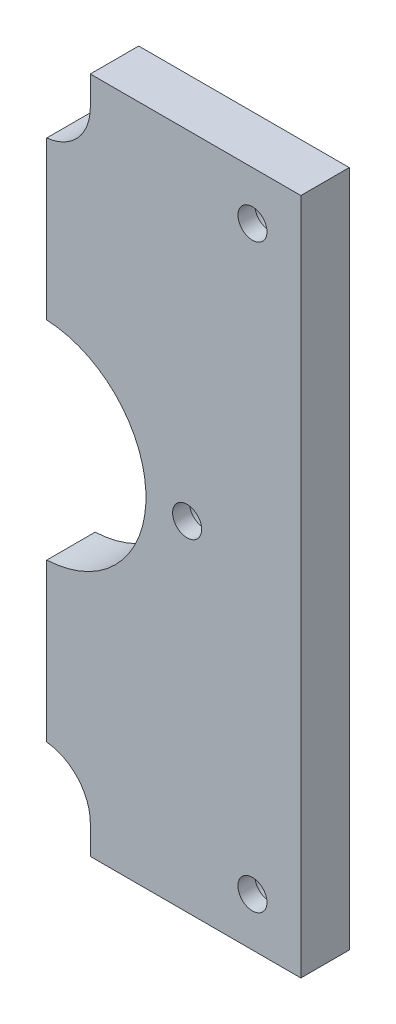
ISO-10303-21;
HEADER;
FILE_DESCRIPTION(('STEP AP214'),'2;1');
FILE_NAME('part.step','',(''),(''),'','','');
FILE_SCHEMA(('AUTOMOTIVE_DESIGN { 1 0 10303 214 1 1 1 1 }'));
ENDSEC;
DATA;
#1=APPLICATION_CONTEXT('core data for automotive mechanical design processes');
#2=APPLICATION_PROTOCOL_DEFINITION('international standard','automotive_design',2000,#1);
#3=PRODUCT_CONTEXT('',#1,'mechanical');
#4=PRODUCT('Part','Part','',(#3));
#5=PRODUCT_RELATED_PRODUCT_CATEGORY('part','',(#4));
#6=PRODUCT_DEFINITION_FORMATION('','',#4);
#7=PRODUCT_DEFINITION_CONTEXT('part definition',#1,'design');
#8=PRODUCT_DEFINITION('design','',#6,#7);
#9=PRODUCT_DEFINITION_SHAPE('','',#8);
#10=(LENGTH_UNIT() NAMED_UNIT(*) SI_UNIT(.MILLI.,.METRE.));
#11=(NAMED_UNIT(*) PLANE_ANGLE_UNIT() SI_UNIT($,.RADIAN.));
#12=(NAMED_UNIT(*) SI_UNIT($,.STERADIAN.) SOLID_ANGLE_UNIT());
#13=UNCERTAINTY_MEASURE_WITH_UNIT(LENGTH_MEASURE(1.E-05),#10,'distance_accuracy_value','');
#14=(GEOMETRIC_REPRESENTATION_CONTEXT(3) GLOBAL_UNCERTAINTY_ASSIGNED_CONTEXT((#13)) GLOBAL_UNIT_ASSIGNED_CONTEXT((#10,
#11,#12)) REPRESENTATION_CONTEXT('',''));
#15=CARTESIAN_POINT('',(0.,0.,0.));
#16=DIRECTION('',(0.,0.,1.));
#17=DIRECTION('',(1.,0.,0.));
#18=AXIS2_PLACEMENT_3D('',#15,#16,#17);
#19=CARTESIAN_POINT('',(80.,130.,10.));
#20=DIRECTION('',(0.,0.,-1.));
#21=DIRECTION('',(-1.,0.,0.));
#22=AXIS2_PLACEMENT_3D('',#19,#20,#21);
#23=CYLINDRICAL_SURFACE('',#22,2.99999999999999);
#24=CARTESIAN_POINT('',(80.,130.,10.));
#25=DIRECTION('',(0.,0.,1.));
#26=DIRECTION('',(1.,0.,0.));
#27=AXIS2_PLACEMENT_3D('',#24,#25,#26);
#28=CIRCLE('',#27,2.99999999999999);
#29=CARTESIAN_POINT('',(83.,130.,10.));
#30=VERTEX_POINT('',#29);
#31=EDGE_CURVE('E180',#30,#30,#28,.T.);
#32=ORIENTED_EDGE('',*,*,#31,.T.);
#33=EDGE_LOOP('',(#32));
#34=FACE_BOUND('',#33,.T.);
#35=CARTESIAN_POINT('',(80.,130.,6.5));
#36=DIRECTION('',(0.,0.,-1.));
#37=DIRECTION('',(-1.,0.,0.));
#38=AXIS2_PLACEMENT_3D('',#35,#36,#37);
#39=CIRCLE('',#38,2.99999999999999);
#40=CARTESIAN_POINT('',(77.0000000000001,130.,6.5));
#41=VERTEX_POINT('',#40);
#42=EDGE_CURVE('E33',#41,#41,#39,.T.);
#43=ORIENTED_EDGE('',*,*,#42,.T.);
#44=EDGE_LOOP('',(#43));
#45=FACE_BOUND('',#44,.T.);
#46=ADVANCED_FACE('F29',(#34,#45),#23,.F.);
#47=CARTESIAN_POINT('',(80.,10.,10.));
#48=DIRECTION('',(0.,0.,-1.));
#49=DIRECTION('',(-1.,0.,0.));
#50=AXIS2_PLACEMENT_3D('',#47,#48,#49);
#51=CYLINDRICAL_SURFACE('',#50,2.99999999999999);
#52=CARTESIAN_POINT('',(80.,10.,10.));
#53=DIRECTION('',(0.,0.,1.));
#54=DIRECTION('',(1.,0.,0.));
#55=AXIS2_PLACEMENT_3D('',#52,#53,#54);
#56=CIRCLE('',#55,2.99999999999999);
#57=CARTESIAN_POINT('',(83.,10.,10.));
#58=VERTEX_POINT('',#57);
#59=EDGE_CURVE('E174',#58,#58,#56,.T.);
#60=ORIENTED_EDGE('',*,*,#59,.T.);
#61=EDGE_LOOP('',(#60));
#62=FACE_BOUND('',#61,.T.);
#63=CARTESIAN_POINT('',(80.,10.,6.5));
#64=DIRECTION('',(0.,0.,-1.));
#65=DIRECTION('',(-1.,0.,0.));
#66=AXIS2_PLACEMENT_3D('',#63,#64,#65);
#67=CIRCLE('',#66,2.99999999999999);
#68=CARTESIAN_POINT('',(77.,10.,6.5));
#69=VERTEX_POINT('',#68);
#70=EDGE_CURVE('E201',#69,#69,#67,.T.);
#71=ORIENTED_EDGE('',*,*,#70,.T.);
#72=EDGE_LOOP('',(#71));
#73=FACE_BOUND('',#72,.T.);
#74=ADVANCED_FACE('F241',(#62,#73),#51,.F.);
#75=CARTESIAN_POINT('',(66.4999999999925,70.,10.));
#76=DIRECTION('',(0.,0.,-1.));
#77=DIRECTION('',(-1.,0.,0.));
#78=AXIS2_PLACEMENT_3D('',#75,#76,#77);
#79=CYLINDRICAL_SURFACE('',#78,3.00000000000001);
#80=CARTESIAN_POINT('',(66.4999999999925,70.,10.));
#81=DIRECTION('',(0.,0.,1.));
#82=DIRECTION('',(1.,0.,0.));
#83=AXIS2_PLACEMENT_3D('',#80,#81,#82);
#84=CIRCLE('',#83,3.00000000000001);
#85=CARTESIAN_POINT('',(69.4999999999925,70.,10.));
#86=VERTEX_POINT('',#85);
#87=EDGE_CURVE('E177',#86,#86,#84,.T.);
#88=ORIENTED_EDGE('',*,*,#87,.T.);
#89=EDGE_LOOP('',(#88));
#90=FACE_BOUND('',#89,.T.);
#91=CARTESIAN_POINT('',(66.4999999999925,70.,6.5));
#92=DIRECTION('',(0.,0.,-1.));
#93=DIRECTION('',(-1.,0.,0.));
#94=AXIS2_PLACEMENT_3D('',#91,#92,#93);
#95=CIRCLE('',#94,3.00000000000001);
#96=CARTESIAN_POINT('',(63.4999999999925,70.,6.5));
#97=VERTEX_POINT('',#96);
#98=EDGE_CURVE('E123',#97,#97,#95,.T.);
#99=ORIENTED_EDGE('',*,*,#98,.T.);
#100=EDGE_LOOP('',(#99));
#101=FACE_BOUND('',#100,.T.);
#102=ADVANCED_FACE('F247',(#90,#101),#79,.F.);
#103=CARTESIAN_POINT('',(36.5,6.00000000000006,10.));
#104=DIRECTION('',(0.,0.,-1.));
#105=DIRECTION('',(-1.,0.,0.));
#106=AXIS2_PLACEMENT_3D('',#103,#104,#105);
#107=CYLINDRICAL_SURFACE('',#106,10.);
#108=CARTESIAN_POINT('',(36.5,6.00000000000006,0.));
#109=DIRECTION('',(0.,0.,1.));
#110=DIRECTION('',(1.,0.,0.));
#111=AXIS2_PLACEMENT_3D('',#108,#109,#110);
#112=CIRCLE('',#111,10.);
#113=CARTESIAN_POINT('',(46.5,6.00000000000003,0.));
#114=VERTEX_POINT('',#113);
#115=CARTESIAN_POINT('',(37.4999405637705,15.9498803444528,0.));
#116=VERTEX_POINT('',#115);
#117=EDGE_CURVE('E118',#114,#116,#112,.T.);
#118=ORIENTED_EDGE('',*,*,#117,.F.);
#119=DIRECTION('',(0.,0.,-1.));
#120=VECTOR('',#119,1.);
#121=CARTESIAN_POINT('',(46.5,6.00000000000003,10.));
#122=LINE('',#121,#120);
#123=CARTESIAN_POINT('',(46.5,6.00000000000003,10.));
#124=VERTEX_POINT('',#123);
#125=EDGE_CURVE('E11',#124,#114,#122,.T.);
#126=ORIENTED_EDGE('',*,*,#125,.F.);
#127=CARTESIAN_POINT('',(36.5,6.00000000000006,10.));
#128=DIRECTION('',(0.,0.,1.));
#129=DIRECTION('',(1.,0.,0.));
#130=AXIS2_PLACEMENT_3D('',#127,#128,#129);
#131=CIRCLE('',#130,10.);
#132=CARTESIAN_POINT('',(37.4999405637705,15.9498803444528,10.));
#133=VERTEX_POINT('',#132);
#134=EDGE_CURVE('E153',#124,#133,#131,.T.);
#135=ORIENTED_EDGE('',*,*,#134,.T.);
#136=DIRECTION('',(0.,0.,-1.));
#137=VECTOR('',#136,1.);
#138=CARTESIAN_POINT('',(37.4999405637705,15.9498803444528,10.));
#139=LINE('',#138,#137);
#140=EDGE_CURVE('E119',#133,#116,#139,.T.);
#141=ORIENTED_EDGE('',*,*,#140,.T.);
#142=EDGE_LOOP('',(#118,#126,#135,#141));
#143=FACE_BOUND('',#142,.T.);
#144=ADVANCED_FACE('F31',(#143),#107,.F.);
#145=CARTESIAN_POINT('',(46.4999999999998,-59.5960466115753,10.));
#146=DIRECTION('',(-1.,0.,0.));
#147=DIRECTION('',(0.,-1.,0.));
#148=AXIS2_PLACEMENT_3D('',#145,#146,#147);
#149=PLANE('',#148);
#150=DIRECTION('',(0.,1.,0.));
#151=VECTOR('',#150,1.);
#152=CARTESIAN_POINT('',(46.4999999999998,-59.5960466115753,0.));
#153=LINE('',#152,#151);
#154=CARTESIAN_POINT('',(46.5,0.,0.));
#155=VERTEX_POINT('',#154);
#156=EDGE_CURVE('E112',#155,#114,#153,.T.);
#157=ORIENTED_EDGE('',*,*,#156,.F.);
#158=DIRECTION('',(0.,0.,-1.));
#159=VECTOR('',#158,1.);
#160=CARTESIAN_POINT('',(46.5,0.,10.));
#161=LINE('',#160,#159);
#162=CARTESIAN_POINT('',(46.5,0.,10.));
#163=VERTEX_POINT('',#162);
#164=EDGE_CURVE('E38',#163,#155,#161,.T.);
#165=ORIENTED_EDGE('',*,*,#164,.F.);
#166=DIRECTION('',(0.,1.,0.));
#167=VECTOR('',#166,1.);
#168=CARTESIAN_POINT('',(46.4999999999998,-59.5960466115753,10.));
#169=LINE('',#168,#167);
#170=EDGE_CURVE('E114',#163,#124,#169,.T.);
#171=ORIENTED_EDGE('',*,*,#170,.T.);
#172=ORIENTED_EDGE('',*,*,#125,.T.);
#173=EDGE_LOOP('',(#157,#165,#171,#172));
#174=FACE_BOUND('',#173,.T.);
#175=ADVANCED_FACE('F110',(#174),#149,.T.);
#176=CARTESIAN_POINT('',(45.,0.,10.));
#177=DIRECTION('',(0.,1.,0.));
#178=DIRECTION('',(-1.,0.,0.));
#179=AXIS2_PLACEMENT_3D('',#176,#177,#178);
#180=PLANE('',#179);
#181=DIRECTION('',(1.,0.,0.));
#182=VECTOR('',#181,1.);
#183=CARTESIAN_POINT('',(45.,0.,0.));
#184=LINE('',#183,#182);
#185=CARTESIAN_POINT('',(90.,0.,0.));
#186=VERTEX_POINT('',#185);
#187=EDGE_CURVE('E128',#155,#186,#184,.T.);
#188=ORIENTED_EDGE('',*,*,#187,.T.);
#189=DIRECTION('',(0.,0.,-1.));
#190=VECTOR('',#189,1.);
#191=CARTESIAN_POINT('',(90.,0.,10.));
#192=LINE('',#191,#190);
#193=CARTESIAN_POINT('',(90.,0.,10.));
#194=VERTEX_POINT('',#193);
#195=EDGE_CURVE('E195',#194,#186,#192,.T.);
#196=ORIENTED_EDGE('',*,*,#195,.F.);
#197=DIRECTION('',(1.,0.,0.));
#198=VECTOR('',#197,1.);
#199=CARTESIAN_POINT('',(45.,0.,10.));
#200=LINE('',#199,#198);
#201=EDGE_CURVE('E156',#163,#194,#200,.T.);
#202=ORIENTED_EDGE('',*,*,#201,.F.);
#203=ORIENTED_EDGE('',*,*,#164,.T.);
#204=EDGE_LOOP('',(#188,#196,#202,#203));
#205=FACE_BOUND('',#204,.T.);
#206=ADVANCED_FACE('F279',(#205),#180,.F.);
#207=CARTESIAN_POINT('',(90.,-59.5960466115753,10.));
#208=DIRECTION('',(-1.,0.,0.));
#209=DIRECTION('',(0.,0.,1.));
#210=AXIS2_PLACEMENT_3D('',#207,#208,#209);
#211=PLANE('',#210);
#212=DIRECTION('',(0.,1.,0.));
#213=VECTOR('',#212,1.);
#214=CARTESIAN_POINT('',(90.,-59.5960466115753,0.));
#215=LINE('',#214,#213);
#216=CARTESIAN_POINT('',(90.,140.,0.));
#217=VERTEX_POINT('',#216);
#218=EDGE_CURVE('E130',#186,#217,#215,.T.);
#219=ORIENTED_EDGE('',*,*,#218,.T.);
#220=DIRECTION('',(0.,0.,-1.));
#221=VECTOR('',#220,1.);
#222=CARTESIAN_POINT('',(90.,140.,10.));
#223=LINE('',#222,#221);
#224=CARTESIAN_POINT('',(90.,140.,10.));
#225=VERTEX_POINT('',#224);
#226=EDGE_CURVE('E193',#225,#217,#223,.T.);
#227=ORIENTED_EDGE('',*,*,#226,.F.);
#228=DIRECTION('',(0.,1.,0.));
#229=VECTOR('',#228,1.);
#230=CARTESIAN_POINT('',(90.,-59.5960466115753,10.));
#231=LINE('',#230,#229);
#232=EDGE_CURVE('E158',#194,#225,#231,.T.);
#233=ORIENTED_EDGE('',*,*,#232,.F.);
#234=ORIENTED_EDGE('',*,*,#195,.T.);
#235=EDGE_LOOP('',(#219,#227,#233,#234));
#236=FACE_BOUND('',#235,.T.);
#237=ADVANCED_FACE('F275',(#236),#211,.F.);
#238=CARTESIAN_POINT('',(45.0000000000001,140.,10.));
#239=DIRECTION('',(0.,1.,0.));
#240=DIRECTION('',(-1.,0.,0.));
#241=AXIS2_PLACEMENT_3D('',#238,#239,#240);
#242=PLANE('',#241);
#243=DIRECTION('',(1.,0.,0.));
#244=VECTOR('',#243,1.);
#245=CARTESIAN_POINT('',(45.0000000000001,140.,0.));
#246=LINE('',#245,#244);
#247=CARTESIAN_POINT('',(46.5,140.,0.));
#248=VERTEX_POINT('',#247);
#249=EDGE_CURVE('E136',#248,#217,#246,.T.);
#250=ORIENTED_EDGE('',*,*,#249,.F.);
#251=DIRECTION('',(0.,0.,-1.));
#252=VECTOR('',#251,1.);
#253=CARTESIAN_POINT('',(46.5,140.,10.));
#254=LINE('',#253,#252);
#255=CARTESIAN_POINT('',(46.5,140.,10.));
#256=VERTEX_POINT('',#255);
#257=EDGE_CURVE('E191',#256,#248,#254,.T.);
#258=ORIENTED_EDGE('',*,*,#257,.F.);
#259=DIRECTION('',(1.,0.,0.));
#260=VECTOR('',#259,1.);
#261=CARTESIAN_POINT('',(45.0000000000001,140.,10.));
#262=LINE('',#261,#260);
#263=EDGE_CURVE('E160',#256,#225,#262,.T.);
#264=ORIENTED_EDGE('',*,*,#263,.T.);
#265=ORIENTED_EDGE('',*,*,#226,.T.);
#266=EDGE_LOOP('',(#250,#258,#264,#265));
#267=FACE_BOUND('',#266,.T.);
#268=ADVANCED_FACE('F271',(#267),#242,.T.);
#269=CARTESIAN_POINT('',(46.5,-59.5960466115753,10.));
#270=DIRECTION('',(1.,0.,0.));
#271=DIRECTION('',(0.,0.,-1.));
#272=AXIS2_PLACEMENT_3D('',#269,#270,#271);
#273=PLANE('',#272);
#274=DIRECTION('',(0.,-1.,0.));
#275=VECTOR('',#274,1.);
#276=CARTESIAN_POINT('',(46.5,-59.5960466115753,0.));
#277=LINE('',#276,#275);
#278=CARTESIAN_POINT('',(46.5,134.,0.));
#279=VERTEX_POINT('',#278);
#280=EDGE_CURVE('E139',#248,#279,#277,.T.);
#281=ORIENTED_EDGE('',*,*,#280,.T.);
#282=DIRECTION('',(0.,0.,-1.));
#283=VECTOR('',#282,1.);
#284=CARTESIAN_POINT('',(46.5,134.,10.));
#285=LINE('',#284,#283);
#286=CARTESIAN_POINT('',(46.5,134.,10.));
#287=VERTEX_POINT('',#286);
#288=EDGE_CURVE('E189',#287,#279,#285,.T.);
#289=ORIENTED_EDGE('',*,*,#288,.F.);
#290=DIRECTION('',(0.,-1.,0.));
#291=VECTOR('',#290,1.);
#292=CARTESIAN_POINT('',(46.5,-59.5960466115753,10.));
#293=LINE('',#292,#291);
#294=EDGE_CURVE('E163',#256,#287,#293,.T.);
#295=ORIENTED_EDGE('',*,*,#294,.F.);
#296=ORIENTED_EDGE('',*,*,#257,.T.);
#297=EDGE_LOOP('',(#281,#289,#295,#296));
#298=FACE_BOUND('',#297,.T.);
#299=ADVANCED_FACE('F267',(#298),#273,.F.);
#300=CARTESIAN_POINT('',(36.5,134.,10.));
#301=DIRECTION('',(0.,0.,-1.));
#302=DIRECTION('',(-1.,0.,0.));
#303=AXIS2_PLACEMENT_3D('',#300,#301,#302);
#304=CYLINDRICAL_SURFACE('',#303,10.);
#305=CARTESIAN_POINT('',(36.5,134.,0.));
#306=DIRECTION('',(0.,0.,1.));
#307=DIRECTION('',(1.,0.,0.));
#308=AXIS2_PLACEMENT_3D('',#305,#306,#307);
#309=CIRCLE('',#308,10.);
#310=CARTESIAN_POINT('',(37.4999405637705,124.050119655547,0.));
#311=VERTEX_POINT('',#310);
#312=EDGE_CURVE('E142',#311,#279,#309,.T.);
#313=ORIENTED_EDGE('',*,*,#312,.F.);
#314=DIRECTION('',(0.,0.,-1.));
#315=VECTOR('',#314,1.);
#316=CARTESIAN_POINT('',(37.4999405637705,124.050119655547,10.));
#317=LINE('',#316,#315);
#318=CARTESIAN_POINT('',(37.4999405637705,124.050119655547,10.));
#319=VERTEX_POINT('',#318);
#320=EDGE_CURVE('E187',#319,#311,#317,.T.);
#321=ORIENTED_EDGE('',*,*,#320,.F.);
#322=CARTESIAN_POINT('',(36.5,134.,10.));
#323=DIRECTION('',(0.,0.,1.));
#324=DIRECTION('',(1.,0.,0.));
#325=AXIS2_PLACEMENT_3D('',#322,#323,#324);
#326=CIRCLE('',#325,10.);
#327=EDGE_CURVE('E165',#319,#287,#326,.T.);
#328=ORIENTED_EDGE('',*,*,#327,.T.);
#329=ORIENTED_EDGE('',*,*,#288,.T.);
#330=EDGE_LOOP('',(#313,#321,#328,#329));
#331=FACE_BOUND('',#330,.T.);
#332=ADVANCED_FACE('F263',(#331),#304,.F.);
#333=CARTESIAN_POINT('',(37.4999405637705,-59.5960466115753,10.));
#334=DIRECTION('',(-1.,0.,0.));
#335=DIRECTION('',(0.,-1.,0.));
#336=AXIS2_PLACEMENT_3D('',#333,#334,#335);
#337=PLANE('',#336);
#338=CARTESIAN_POINT('',(37.4999405637705,98.976734362303,5.));
#339=DIRECTION('',(-1.,0.,0.));
#340=DIRECTION('',(0.,0.,1.));
#341=AXIS2_PLACEMENT_3D('',#338,#339,#340);
#342=CIRCLE('',#341,4.);
#343=CARTESIAN_POINT('',(37.4999405637705,98.976734362303,9.));
#344=VERTEX_POINT('',#343);
#345=EDGE_CURVE('E460',#344,#344,#342,.T.);
#346=ORIENTED_EDGE('',*,*,#345,.F.);
#347=EDGE_LOOP('',(#346));
#348=FACE_BOUND('',#347,.T.);
#349=CARTESIAN_POINT('',(37.4999405637705,110.,5.));
#350=DIRECTION('',(-1.,0.,0.));
#351=DIRECTION('',(0.,-1.,0.));
#352=AXIS2_PLACEMENT_3D('',#349,#350,#351);
#353=CIRCLE('',#352,2.25);
#354=CARTESIAN_POINT('',(37.4999405637705,107.75,5.));
#355=VERTEX_POINT('',#354);
#356=EDGE_CURVE('E474',#355,#355,#353,.T.);
#357=ORIENTED_EDGE('',*,*,#356,.F.);
#358=EDGE_LOOP('',(#357));
#359=FACE_BOUND('',#358,.T.);
#360=DIRECTION('',(0.,1.,0.));
#361=VECTOR('',#360,1.);
#362=CARTESIAN_POINT('',(37.4999405637705,-59.5960466115753,0.));
#363=LINE('',#362,#361);
#364=CARTESIAN_POINT('',(37.4999405637705,91.476734362303,0.));
#365=VERTEX_POINT('',#364);
#366=EDGE_CURVE('E145',#365,#311,#363,.T.);
#367=ORIENTED_EDGE('',*,*,#366,.F.);
#368=DIRECTION('',(0.,0.,-1.));
#369=VECTOR('',#368,1.);
#370=CARTESIAN_POINT('',(37.4999405637705,91.476734362303,10.));
#371=LINE('',#370,#369);
#372=CARTESIAN_POINT('',(37.4999405637705,91.476734362303,10.));
#373=VERTEX_POINT('',#372);
#374=EDGE_CURVE('E185',#373,#365,#371,.T.);
#375=ORIENTED_EDGE('',*,*,#374,.F.);
#376=DIRECTION('',(0.,1.,0.));
#377=VECTOR('',#376,1.);
#378=CARTESIAN_POINT('',(37.4999405637705,-59.5960466115753,10.));
#379=LINE('',#378,#377);
#380=EDGE_CURVE('E168',#373,#319,#379,.T.);
#381=ORIENTED_EDGE('',*,*,#380,.T.);
#382=ORIENTED_EDGE('',*,*,#320,.T.);
#383=EDGE_LOOP('',(#367,#375,#381,#382));
#384=FACE_BOUND('',#383,.T.);
#385=ADVANCED_FACE('F260',(#348,#359,#384),#337,.T.);
#386=CARTESIAN_POINT('',(36.5,70.,10.));
#387=DIRECTION('',(0.,0.,-1.));
#388=DIRECTION('',(-1.,0.,0.));
#389=AXIS2_PLACEMENT_3D('',#386,#387,#388);
#390=CYLINDRICAL_SURFACE('',#389,21.5);
#391=CARTESIAN_POINT('',(36.5,70.,0.));
#392=DIRECTION('',(0.,0.,1.));
#393=DIRECTION('',(1.,0.,0.));
#394=AXIS2_PLACEMENT_3D('',#391,#392,#393);
#395=CIRCLE('',#394,21.5);
#396=CARTESIAN_POINT('',(37.4999405637705,48.5232656376971,0.));
#397=VERTEX_POINT('',#396);
#398=EDGE_CURVE('E148',#397,#365,#395,.T.);
#399=ORIENTED_EDGE('',*,*,#398,.F.);
#400=DIRECTION('',(0.,0.,-1.));
#401=VECTOR('',#400,1.);
#402=CARTESIAN_POINT('',(37.4999405637705,48.5232656376971,10.));
#403=LINE('',#402,#401);
#404=CARTESIAN_POINT('',(37.4999405637705,48.5232656376971,10.));
#405=VERTEX_POINT('',#404);
#406=EDGE_CURVE('E54',#405,#397,#403,.T.);
#407=ORIENTED_EDGE('',*,*,#406,.F.);
#408=CARTESIAN_POINT('',(36.5,70.,10.));
#409=DIRECTION('',(0.,0.,1.));
#410=DIRECTION('',(1.,0.,0.));
#411=AXIS2_PLACEMENT_3D('',#408,#409,#410);
#412=CIRCLE('',#411,21.5);
#413=EDGE_CURVE('E171',#405,#373,#412,.T.);
#414=ORIENTED_EDGE('',*,*,#413,.T.);
#415=ORIENTED_EDGE('',*,*,#374,.T.);
#416=EDGE_LOOP('',(#399,#407,#414,#415));
#417=FACE_BOUND('',#416,.T.);
#418=ADVANCED_FACE('F256',(#417),#390,.F.);
#419=CARTESIAN_POINT('',(37.4999405637705,-59.5960466115753,10.));
#420=DIRECTION('',(1.,0.,0.));
#421=DIRECTION('',(0.,0.,-1.));
#422=AXIS2_PLACEMENT_3D('',#419,#420,#421);
#423=PLANE('',#422);
#424=CARTESIAN_POINT('',(37.4999405637705,41.0232656376971,5.));
#425=DIRECTION('',(-1.,0.,0.));
#426=DIRECTION('',(0.,0.,1.));
#427=AXIS2_PLACEMENT_3D('',#424,#425,#426);
#428=CIRCLE('',#427,4.);
#429=CARTESIAN_POINT('',(37.4999405637705,41.0232656376971,9.));
#430=VERTEX_POINT('',#429);
#431=EDGE_CURVE('E457',#430,#430,#428,.T.);
#432=ORIENTED_EDGE('',*,*,#431,.F.);
#433=EDGE_LOOP('',(#432));
#434=FACE_BOUND('',#433,.T.);
#435=CARTESIAN_POINT('',(37.4999405637705,30.,5.00000000000002));
#436=DIRECTION('',(-1.,0.,0.));
#437=DIRECTION('',(0.,-1.,0.));
#438=AXIS2_PLACEMENT_3D('',#435,#436,#437);
#439=CIRCLE('',#438,2.25);
#440=CARTESIAN_POINT('',(37.4999405637705,27.75,5.00000000000002));
#441=VERTEX_POINT('',#440);
#442=EDGE_CURVE('E468',#441,#441,#439,.T.);
#443=ORIENTED_EDGE('',*,*,#442,.F.);
#444=EDGE_LOOP('',(#443));
#445=FACE_BOUND('',#444,.T.);
#446=DIRECTION('',(0.,-1.,0.));
#447=VECTOR('',#446,1.);
#448=CARTESIAN_POINT('',(37.4999405637705,-59.5960466115753,0.));
#449=LINE('',#448,#447);
#450=EDGE_CURVE('E151',#397,#116,#449,.T.);
#451=ORIENTED_EDGE('',*,*,#450,.T.);
#452=ORIENTED_EDGE('',*,*,#140,.F.);
#453=DIRECTION('',(0.,-1.,0.));
#454=VECTOR('',#453,1.);
#455=CARTESIAN_POINT('',(37.4999405637705,-59.5960466115753,10.));
#456=LINE('',#455,#454);
#457=EDGE_CURVE('E46',#405,#133,#456,.T.);
#458=ORIENTED_EDGE('',*,*,#457,.F.);
#459=ORIENTED_EDGE('',*,*,#406,.T.);
#460=EDGE_LOOP('',(#451,#452,#458,#459));
#461=FACE_BOUND('',#460,.T.);
#462=ADVANCED_FACE('F236',(#434,#445,#461),#423,.F.);
#463=CARTESIAN_POINT('',(45.,-59.5960466115753,10.));
#464=DIRECTION('',(0.,0.,1.));
#465=DIRECTION('',(1.,0.,0.));
#466=AXIS2_PLACEMENT_3D('',#463,#464,#465);
#467=PLANE('',#466);
#468=ORIENTED_EDGE('',*,*,#134,.F.);
#469=ORIENTED_EDGE('',*,*,#170,.F.);
#470=ORIENTED_EDGE('',*,*,#201,.T.);
#471=ORIENTED_EDGE('',*,*,#232,.T.);
#472=ORIENTED_EDGE('',*,*,#263,.F.);
#473=ORIENTED_EDGE('',*,*,#294,.T.);
#474=ORIENTED_EDGE('',*,*,#327,.F.);
#475=ORIENTED_EDGE('',*,*,#380,.F.);
#476=ORIENTED_EDGE('',*,*,#413,.F.);
#477=ORIENTED_EDGE('',*,*,#457,.T.);
#478=EDGE_LOOP('',(#468,#469,#470,#471,#472,#473,#474,#475,#476,#477));
#479=FACE_BOUND('',#478,.T.);
#480=ORIENTED_EDGE('',*,*,#59,.F.);
#481=EDGE_LOOP('',(#480));
#482=FACE_BOUND('',#481,.T.);
#483=ORIENTED_EDGE('',*,*,#87,.F.);
#484=EDGE_LOOP('',(#483));
#485=FACE_BOUND('',#484,.T.);
#486=ORIENTED_EDGE('',*,*,#31,.F.);
#487=EDGE_LOOP('',(#486));
#488=FACE_BOUND('',#487,.T.);
#489=ADVANCED_FACE('F229',(#479,#482,#485,#488),#467,.T.);
#490=CARTESIAN_POINT('',(45.,-59.5960466115753,0.));
#491=DIRECTION('',(0.,0.,1.));
#492=DIRECTION('',(1.,0.,0.));
#493=AXIS2_PLACEMENT_3D('',#490,#491,#492);
#494=PLANE('',#493);
#495=CARTESIAN_POINT('',(80.,130.,0.));
#496=DIRECTION('',(0.,0.,-1.));
#497=DIRECTION('',(-1.,0.,0.));
#498=AXIS2_PLACEMENT_3D('',#495,#496,#497);
#499=CIRCLE('',#498,5.00000000000001);
#500=CARTESIAN_POINT('',(75.,130.,0.));
#501=VERTEX_POINT('',#500);
#502=EDGE_CURVE('E480',#501,#501,#499,.T.);
#503=ORIENTED_EDGE('',*,*,#502,.F.);
#504=EDGE_LOOP('',(#503));
#505=FACE_BOUND('',#504,.T.);
#506=CARTESIAN_POINT('',(80.,10.,0.));
#507=DIRECTION('',(0.,0.,-1.));
#508=DIRECTION('',(-1.,0.,0.));
#509=AXIS2_PLACEMENT_3D('',#506,#507,#508);
#510=CIRCLE('',#509,5.);
#511=CARTESIAN_POINT('',(75.,10.,0.));
#512=VERTEX_POINT('',#511);
#513=EDGE_CURVE('E210',#512,#512,#510,.T.);
#514=ORIENTED_EDGE('',*,*,#513,.F.);
#515=EDGE_LOOP('',(#514));
#516=FACE_BOUND('',#515,.T.);
#517=CARTESIAN_POINT('',(66.4999999999925,70.,0.));
#518=DIRECTION('',(0.,0.,-1.));
#519=DIRECTION('',(-1.,0.,0.));
#520=AXIS2_PLACEMENT_3D('',#517,#518,#519);
#521=CIRCLE('',#520,5.);
#522=CARTESIAN_POINT('',(61.4999999999925,70.,0.));
#523=VERTEX_POINT('',#522);
#524=EDGE_CURVE('E203',#523,#523,#521,.T.);
#525=ORIENTED_EDGE('',*,*,#524,.F.);
#526=EDGE_LOOP('',(#525));
#527=FACE_BOUND('',#526,.T.);
#528=ORIENTED_EDGE('',*,*,#117,.T.);
#529=ORIENTED_EDGE('',*,*,#450,.F.);
#530=ORIENTED_EDGE('',*,*,#398,.T.);
#531=ORIENTED_EDGE('',*,*,#366,.T.);
#532=ORIENTED_EDGE('',*,*,#312,.T.);
#533=ORIENTED_EDGE('',*,*,#280,.F.);
#534=ORIENTED_EDGE('',*,*,#249,.T.);
#535=ORIENTED_EDGE('',*,*,#218,.F.);
#536=ORIENTED_EDGE('',*,*,#187,.F.);
#537=ORIENTED_EDGE('',*,*,#156,.T.);
#538=EDGE_LOOP('',(#528,#529,#530,#531,#532,#533,#534,#535,#536,#537));
#539=FACE_BOUND('',#538,.T.);
#540=ADVANCED_FACE('F126',(#505,#516,#527,#539),#494,.F.);
#541=CARTESIAN_POINT('',(66.4999999999925,70.,6.5));
#542=DIRECTION('',(0.,0.,-1.));
#543=DIRECTION('',(-1.,0.,0.));
#544=AXIS2_PLACEMENT_3D('',#541,#542,#543);
#545=CYLINDRICAL_SURFACE('',#544,5.);
#546=CARTESIAN_POINT('',(66.4999999999925,70.,6.5));
#547=DIRECTION('',(0.,0.,-1.));
#548=DIRECTION('',(-1.,0.,0.));
#549=AXIS2_PLACEMENT_3D('',#546,#547,#548);
#550=CIRCLE('',#549,5.);
#551=CARTESIAN_POINT('',(61.4999999999925,70.,6.5));
#552=VERTEX_POINT('',#551);
#553=EDGE_CURVE('E200',#552,#552,#550,.T.);
#554=ORIENTED_EDGE('',*,*,#553,.F.);
#555=EDGE_LOOP('',(#554));
#556=FACE_BOUND('',#555,.T.);
#557=ORIENTED_EDGE('',*,*,#524,.T.);
#558=EDGE_LOOP('',(#557));
#559=FACE_BOUND('',#558,.T.);
#560=ADVANCED_FACE('F222',(#556,#559),#545,.F.);
#561=CARTESIAN_POINT('',(66.4999999999925,70.,6.5));
#562=DIRECTION('',(0.,0.,-1.));
#563=DIRECTION('',(-1.,0.,0.));
#564=AXIS2_PLACEMENT_3D('',#561,#562,#563);
#565=PLANE('',#564);
#566=ORIENTED_EDGE('',*,*,#98,.F.);
#567=EDGE_LOOP('',(#566));
#568=FACE_BOUND('',#567,.T.);
#569=ORIENTED_EDGE('',*,*,#553,.T.);
#570=EDGE_LOOP('',(#569));
#571=FACE_BOUND('',#570,.T.);
#572=ADVANCED_FACE('F220',(#568,#571),#565,.T.);
#573=CARTESIAN_POINT('',(80.,10.,6.5));
#574=DIRECTION('',(0.,0.,-1.));
#575=DIRECTION('',(-1.,0.,0.));
#576=AXIS2_PLACEMENT_3D('',#573,#574,#575);
#577=CYLINDRICAL_SURFACE('',#576,5.);
#578=CARTESIAN_POINT('',(80.,10.,6.5));
#579=DIRECTION('',(0.,0.,-1.));
#580=DIRECTION('',(-1.,0.,0.));
#581=AXIS2_PLACEMENT_3D('',#578,#579,#580);
#582=CIRCLE('',#581,5.);
#583=CARTESIAN_POINT('',(75.,10.,6.5));
#584=VERTEX_POINT('',#583);
#585=EDGE_CURVE('E204',#584,#584,#582,.T.);
#586=ORIENTED_EDGE('',*,*,#585,.F.);
#587=EDGE_LOOP('',(#586));
#588=FACE_BOUND('',#587,.T.);
#589=ORIENTED_EDGE('',*,*,#513,.T.);
#590=EDGE_LOOP('',(#589));
#591=FACE_BOUND('',#590,.T.);
#592=ADVANCED_FACE('F358',(#588,#591),#577,.F.);
#593=CARTESIAN_POINT('',(80.,10.,6.5));
#594=DIRECTION('',(0.,0.,-1.));
#595=DIRECTION('',(-1.,0.,0.));
#596=AXIS2_PLACEMENT_3D('',#593,#594,#595);
#597=PLANE('',#596);
#598=ORIENTED_EDGE('',*,*,#70,.F.);
#599=EDGE_LOOP('',(#598));
#600=FACE_BOUND('',#599,.T.);
#601=ORIENTED_EDGE('',*,*,#585,.T.);
#602=EDGE_LOOP('',(#601));
#603=FACE_BOUND('',#602,.T.);
#604=ADVANCED_FACE('F366',(#600,#603),#597,.T.);
#605=CARTESIAN_POINT('',(80.,130.,6.5));
#606=DIRECTION('',(0.,0.,-1.));
#607=DIRECTION('',(-1.,0.,0.));
#608=AXIS2_PLACEMENT_3D('',#605,#606,#607);
#609=CYLINDRICAL_SURFACE('',#608,5.00000000000001);
#610=CARTESIAN_POINT('',(80.,130.,6.5));
#611=DIRECTION('',(0.,0.,-1.));
#612=DIRECTION('',(-1.,0.,0.));
#613=AXIS2_PLACEMENT_3D('',#610,#611,#612);
#614=CIRCLE('',#613,5.00000000000001);
#615=CARTESIAN_POINT('',(75.,130.,6.5));
#616=VERTEX_POINT('',#615);
#617=EDGE_CURVE('E482',#616,#616,#614,.T.);
#618=ORIENTED_EDGE('',*,*,#617,.F.);
#619=EDGE_LOOP('',(#618));
#620=FACE_BOUND('',#619,.T.);
#621=ORIENTED_EDGE('',*,*,#502,.T.);
#622=EDGE_LOOP('',(#621));
#623=FACE_BOUND('',#622,.T.);
#624=ADVANCED_FACE('F374',(#620,#623),#609,.F.);
#625=CARTESIAN_POINT('',(80.,130.,6.5));
#626=DIRECTION('',(0.,0.,-1.));
#627=DIRECTION('',(-1.,0.,0.));
#628=AXIS2_PLACEMENT_3D('',#625,#626,#627);
#629=PLANE('',#628);
#630=ORIENTED_EDGE('',*,*,#42,.F.);
#631=EDGE_LOOP('',(#630));
#632=FACE_BOUND('',#631,.T.);
#633=ORIENTED_EDGE('',*,*,#617,.T.);
#634=EDGE_LOOP('',(#633));
#635=FACE_BOUND('',#634,.T.);
#636=ADVANCED_FACE('F382',(#632,#635),#629,.T.);
#637=CARTESIAN_POINT('',(57.4999405637705,110.,5.));
#638=DIRECTION('',(-1.,0.,0.));
#639=DIRECTION('',(0.,-1.,0.));
#640=AXIS2_PLACEMENT_3D('',#637,#638,#639);
#641=CYLINDRICAL_SURFACE('',#640,2.25);
#642=CARTESIAN_POINT('',(57.4999405637705,110.,5.));
#643=DIRECTION('',(-1.,0.,0.));
#644=DIRECTION('',(0.,-1.,0.));
#645=AXIS2_PLACEMENT_3D('',#642,#643,#644);
#646=CIRCLE('',#645,2.25);
#647=CARTESIAN_POINT('',(57.4999405637705,107.75,5.));
#648=VERTEX_POINT('',#647);
#649=EDGE_CURVE('E477',#648,#648,#646,.T.);
#650=ORIENTED_EDGE('',*,*,#649,.F.);
#651=EDGE_LOOP('',(#650));
#652=FACE_BOUND('',#651,.T.);
#653=ORIENTED_EDGE('',*,*,#356,.T.);
#654=EDGE_LOOP('',(#653));
#655=FACE_BOUND('',#654,.T.);
#656=ADVANCED_FACE('F390',(#652,#655),#641,.F.);
#657=CARTESIAN_POINT('',(57.4999405637705,110.,5.));
#658=DIRECTION('',(-1.,0.,0.));
#659=DIRECTION('',(0.,-1.,0.));
#660=AXIS2_PLACEMENT_3D('',#657,#658,#659);
#661=PLANE('',#660);
#662=ORIENTED_EDGE('',*,*,#649,.T.);
#663=EDGE_LOOP('',(#662));
#664=FACE_BOUND('',#663,.T.);
#665=ADVANCED_FACE('F398',(#664),#661,.T.);
#666=CARTESIAN_POINT('',(57.4999405637705,30.,5.00000000000002));
#667=DIRECTION('',(-1.,0.,0.));
#668=DIRECTION('',(0.,-1.,0.));
#669=AXIS2_PLACEMENT_3D('',#666,#667,#668);
#670=CYLINDRICAL_SURFACE('',#669,2.25);
#671=CARTESIAN_POINT('',(57.4999405637705,30.,5.00000000000002));
#672=DIRECTION('',(-1.,0.,0.));
#673=DIRECTION('',(0.,-1.,0.));
#674=AXIS2_PLACEMENT_3D('',#671,#672,#673);
#675=CIRCLE('',#674,2.25);
#676=CARTESIAN_POINT('',(57.4999405637705,27.75,5.00000000000002));
#677=VERTEX_POINT('',#676);
#678=EDGE_CURVE('E471',#677,#677,#675,.T.);
#679=ORIENTED_EDGE('',*,*,#678,.F.);
#680=EDGE_LOOP('',(#679));
#681=FACE_BOUND('',#680,.T.);
#682=ORIENTED_EDGE('',*,*,#442,.T.);
#683=EDGE_LOOP('',(#682));
#684=FACE_BOUND('',#683,.T.);
#685=ADVANCED_FACE('F406',(#681,#684),#670,.F.);
#686=CARTESIAN_POINT('',(57.4999405637705,30.,5.00000000000002));
#687=DIRECTION('',(-1.,0.,0.));
#688=DIRECTION('',(0.,-1.,0.));
#689=AXIS2_PLACEMENT_3D('',#686,#687,#688);
#690=PLANE('',#689);
#691=ORIENTED_EDGE('',*,*,#678,.T.);
#692=EDGE_LOOP('',(#691));
#693=FACE_BOUND('',#692,.T.);
#694=ADVANCED_FACE('F414',(#693),#690,.T.);
#695=CARTESIAN_POINT('',(47.4999405637705,98.976734362303,5.));
#696=DIRECTION('',(-1.,0.,0.));
#697=DIRECTION('',(0.,-1.,0.));
#698=AXIS2_PLACEMENT_3D('',#695,#696,#697);
#699=CYLINDRICAL_SURFACE('',#698,4.);
#700=CARTESIAN_POINT('',(47.4999405637705,98.976734362303,5.));
#701=DIRECTION('',(-1.,0.,0.));
#702=DIRECTION('',(0.,0.,1.));
#703=AXIS2_PLACEMENT_3D('',#700,#701,#702);
#704=CIRCLE('',#703,4.);
#705=CARTESIAN_POINT('',(47.4999405637705,98.976734362303,9.));
#706=VERTEX_POINT('',#705);
#707=EDGE_CURVE('E465',#706,#706,#704,.T.);
#708=ORIENTED_EDGE('',*,*,#707,.F.);
#709=EDGE_LOOP('',(#708));
#710=FACE_BOUND('',#709,.T.);
#711=ORIENTED_EDGE('',*,*,#345,.T.);
#712=EDGE_LOOP('',(#711));
#713=FACE_BOUND('',#712,.T.);
#714=ADVANCED_FACE('F421',(#710,#713),#699,.F.);
#715=CARTESIAN_POINT('',(47.4999405637705,98.976734362303,5.));
#716=DIRECTION('',(-1.,0.,0.));
#717=DIRECTION('',(0.,0.,1.));
#718=AXIS2_PLACEMENT_3D('',#715,#716,#717);
#719=PLANE('',#718);
#720=ORIENTED_EDGE('',*,*,#707,.T.);
#721=EDGE_LOOP('',(#720));
#722=FACE_BOUND('',#721,.T.);
#723=ADVANCED_FACE('F428',(#722),#719,.T.);
#724=CARTESIAN_POINT('',(47.4999405637705,41.0232656376971,5.));
#725=DIRECTION('',(-1.,0.,0.));
#726=DIRECTION('',(0.,-1.,0.));
#727=AXIS2_PLACEMENT_3D('',#724,#725,#726);
#728=CYLINDRICAL_SURFACE('',#727,4.);
#729=CARTESIAN_POINT('',(47.4999405637705,41.0232656376971,5.));
#730=DIRECTION('',(-1.,0.,0.));
#731=DIRECTION('',(0.,0.,1.));
#732=AXIS2_PLACEMENT_3D('',#729,#730,#731);
#733=CIRCLE('',#732,4.);
#734=CARTESIAN_POINT('',(47.4999405637705,41.0232656376971,9.));
#735=VERTEX_POINT('',#734);
#736=EDGE_CURVE('E456',#735,#735,#733,.T.);
#737=ORIENTED_EDGE('',*,*,#736,.F.);
#738=EDGE_LOOP('',(#737));
#739=FACE_BOUND('',#738,.T.);
#740=ORIENTED_EDGE('',*,*,#431,.T.);
#741=EDGE_LOOP('',(#740));
#742=FACE_BOUND('',#741,.T.);
#743=ADVANCED_FACE('F436',(#739,#742),#728,.F.);
#744=CARTESIAN_POINT('',(47.4999405637705,41.0232656376971,5.));
#745=DIRECTION('',(-1.,0.,0.));
#746=DIRECTION('',(0.,0.,1.));
#747=AXIS2_PLACEMENT_3D('',#744,#745,#746);
#748=PLANE('',#747);
#749=ORIENTED_EDGE('',*,*,#736,.T.);
#750=EDGE_LOOP('',(#749));
#751=FACE_BOUND('',#750,.T.);
#752=ADVANCED_FACE('F444',(#751),#748,.T.);
#753=CLOSED_SHELL('',(#46,#74,#102,#144,#175,#206,#237,#268,#299,#332,#385,#418,#462,#489,#540,
#560,#572,#592,#604,#624,#636,#656,#665,#685,#694,#714,#723,#743,#752));
#754=MANIFOLD_SOLID_BREP('B2',#753);
#755=ADVANCED_BREP_SHAPE_REPRESENTATION('',(#18,#754),#14);
#756=SHAPE_DEFINITION_REPRESENTATION(#9,#755);
ENDSEC;
END-ISO-10303-21;
